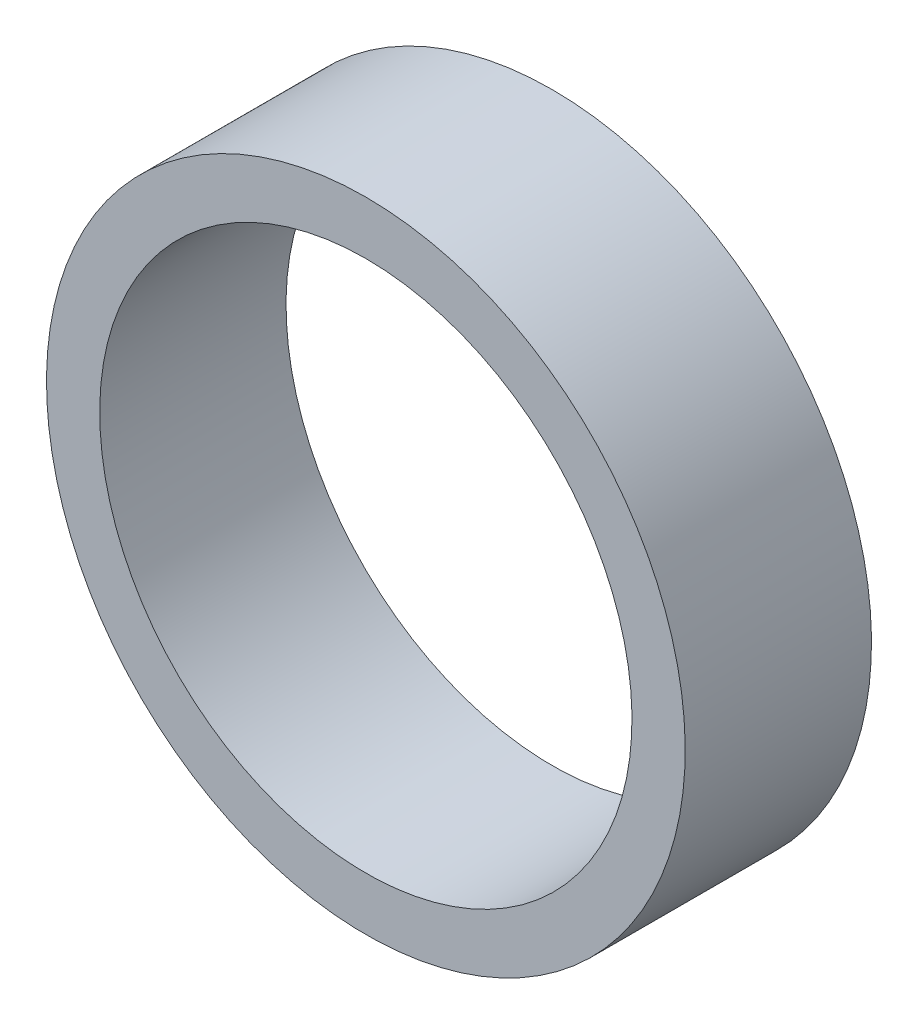
ISO-10303-21;
HEADER;
FILE_DESCRIPTION(('STEP AP214'),'2;1');
FILE_NAME('part.step','',(''),(''),'','','');
FILE_SCHEMA(('AUTOMOTIVE_DESIGN { 1 0 10303 214 1 1 1 1 }'));
ENDSEC;
DATA;
#1=APPLICATION_CONTEXT('core data for automotive mechanical design processes');
#2=APPLICATION_PROTOCOL_DEFINITION('international standard','automotive_design',2000,#1);
#3=PRODUCT_CONTEXT('',#1,'mechanical');
#4=PRODUCT('Part','Part','',(#3));
#5=PRODUCT_RELATED_PRODUCT_CATEGORY('part','',(#4));
#6=PRODUCT_DEFINITION_FORMATION('','',#4);
#7=PRODUCT_DEFINITION_CONTEXT('part definition',#1,'design');
#8=PRODUCT_DEFINITION('design','',#6,#7);
#9=PRODUCT_DEFINITION_SHAPE('','',#8);
#10=(LENGTH_UNIT() NAMED_UNIT(*) SI_UNIT(.MILLI.,.METRE.));
#11=(NAMED_UNIT(*) PLANE_ANGLE_UNIT() SI_UNIT($,.RADIAN.));
#12=(NAMED_UNIT(*) SI_UNIT($,.STERADIAN.) SOLID_ANGLE_UNIT());
#13=UNCERTAINTY_MEASURE_WITH_UNIT(LENGTH_MEASURE(1.E-05),#10,'distance_accuracy_value','');
#14=(GEOMETRIC_REPRESENTATION_CONTEXT(3) GLOBAL_UNCERTAINTY_ASSIGNED_CONTEXT((#13)) GLOBAL_UNIT_ASSIGNED_CONTEXT((#10,
#11,#12)) REPRESENTATION_CONTEXT('',''));
#15=CARTESIAN_POINT('',(0.,0.,0.));
#16=DIRECTION('',(0.,0.,1.));
#17=DIRECTION('',(1.,0.,0.));
#18=AXIS2_PLACEMENT_3D('',#15,#16,#17);
#19=CARTESIAN_POINT('',(0.,6.,367.053390593275));
#20=DIRECTION('',(0.,-1.09345794648833E-13,1.));
#21=DIRECTION('',(0.,-1.,-1.09345794648833E-13));
#22=AXIS2_PLACEMENT_3D('',#19,#20,#21);
#23=PLANE('',#22);
#24=CARTESIAN_POINT('',(0.,0.,367.053390593275));
#25=DIRECTION('',(0.,1.09345794648833E-13,-1.));
#26=DIRECTION('',(0.,1.,1.09345794648833E-13));
#27=AXIS2_PLACEMENT_3D('',#24,#25,#26);
#28=CIRCLE('',#27,5.);
#29=CARTESIAN_POINT('',(0.,5.,367.053390593275));
#30=VERTEX_POINT('',#29);
#31=EDGE_CURVE('E10',#30,#30,#28,.T.);
#32=ORIENTED_EDGE('',*,*,#31,.T.);
#33=EDGE_LOOP('',(#32));
#34=FACE_BOUND('',#33,.T.);
#35=CARTESIAN_POINT('',(0.,0.,367.053390593275));
#36=DIRECTION('',(0.,1.09345794648833E-13,-1.));
#37=DIRECTION('',(0.,1.,1.09345794648833E-13));
#38=AXIS2_PLACEMENT_3D('',#35,#36,#37);
#39=CIRCLE('',#38,6.);
#40=CARTESIAN_POINT('',(0.,6.,367.053390593275));
#41=VERTEX_POINT('',#40);
#42=EDGE_CURVE('E47',#41,#41,#39,.T.);
#43=ORIENTED_EDGE('',*,*,#42,.F.);
#44=EDGE_LOOP('',(#43));
#45=FACE_BOUND('',#44,.T.);
#46=ADVANCED_FACE('F33',(#34,#45),#23,.T.);
#47=CARTESIAN_POINT('',(0.,1.47451495458029E-12,353.553390593276));
#48=DIRECTION('',(0.,1.09345794648833E-13,-1.));
#49=DIRECTION('',(0.,1.,1.09345794648833E-13));
#50=AXIS2_PLACEMENT_3D('',#47,#48,#49);
#51=CYLINDRICAL_SURFACE('',#50,4.99999999999981);
#52=CARTESIAN_POINT('',(0.,3.81057008092243E-13,363.553390593274));
#53=DIRECTION('',(0.,1.09345794648833E-13,-1.));
#54=DIRECTION('',(0.,1.,1.09345794648833E-13));
#55=AXIS2_PLACEMENT_3D('',#52,#53,#54);
#56=CIRCLE('',#55,4.99999999999962);
#57=CARTESIAN_POINT('',(0.,5.,363.553390593274));
#58=VERTEX_POINT('',#57);
#59=EDGE_CURVE('E39',#58,#58,#56,.T.);
#60=ORIENTED_EDGE('',*,*,#59,.T.);
#61=EDGE_LOOP('',(#60));
#62=FACE_BOUND('',#61,.T.);
#63=ORIENTED_EDGE('',*,*,#31,.F.);
#64=EDGE_LOOP('',(#63));
#65=FACE_BOUND('',#64,.T.);
#66=ADVANCED_FACE('F57',(#62,#65),#51,.F.);
#67=CARTESIAN_POINT('',(0.,6.,363.553390593274));
#68=DIRECTION('',(0.,1.09345794648833E-13,-1.));
#69=DIRECTION('',(0.,1.,1.09345794648833E-13));
#70=AXIS2_PLACEMENT_3D('',#67,#68,#69);
#71=PLANE('',#70);
#72=CARTESIAN_POINT('',(0.,3.81057008092255E-13,363.553390593274));
#73=DIRECTION('',(0.,1.09345794648833E-13,-1.));
#74=DIRECTION('',(0.,1.,1.09345794648833E-13));
#75=AXIS2_PLACEMENT_3D('',#72,#73,#74);
#76=CIRCLE('',#75,5.99999999999962);
#77=CARTESIAN_POINT('',(0.,6.,363.553390593274));
#78=VERTEX_POINT('',#77);
#79=EDGE_CURVE('E43',#78,#78,#76,.T.);
#80=ORIENTED_EDGE('',*,*,#79,.T.);
#81=EDGE_LOOP('',(#80));
#82=FACE_BOUND('',#81,.T.);
#83=ORIENTED_EDGE('',*,*,#59,.F.);
#84=EDGE_LOOP('',(#83));
#85=FACE_BOUND('',#84,.T.);
#86=ADVANCED_FACE('F61',(#82,#85),#71,.T.);
#87=CARTESIAN_POINT('',(0.,1.47451495458029E-12,353.553390593276));
#88=DIRECTION('',(0.,1.09345794648833E-13,-1.));
#89=DIRECTION('',(0.,1.,1.09345794648833E-13));
#90=AXIS2_PLACEMENT_3D('',#87,#88,#89);
#91=CYLINDRICAL_SURFACE('',#90,5.99999999999981);
#92=ORIENTED_EDGE('',*,*,#42,.T.);
#93=EDGE_LOOP('',(#92));
#94=FACE_BOUND('',#93,.T.);
#95=ORIENTED_EDGE('',*,*,#79,.F.);
#96=EDGE_LOOP('',(#95));
#97=FACE_BOUND('',#96,.T.);
#98=ADVANCED_FACE('F53',(#94,#97),#91,.T.);
#99=CLOSED_SHELL('',(#46,#66,#86,#98));
#100=MANIFOLD_SOLID_BREP('B2',#99);
#101=ADVANCED_BREP_SHAPE_REPRESENTATION('',(#18,#100),#14);
#102=SHAPE_DEFINITION_REPRESENTATION(#9,#101);
ENDSEC;
END-ISO-10303-21;
